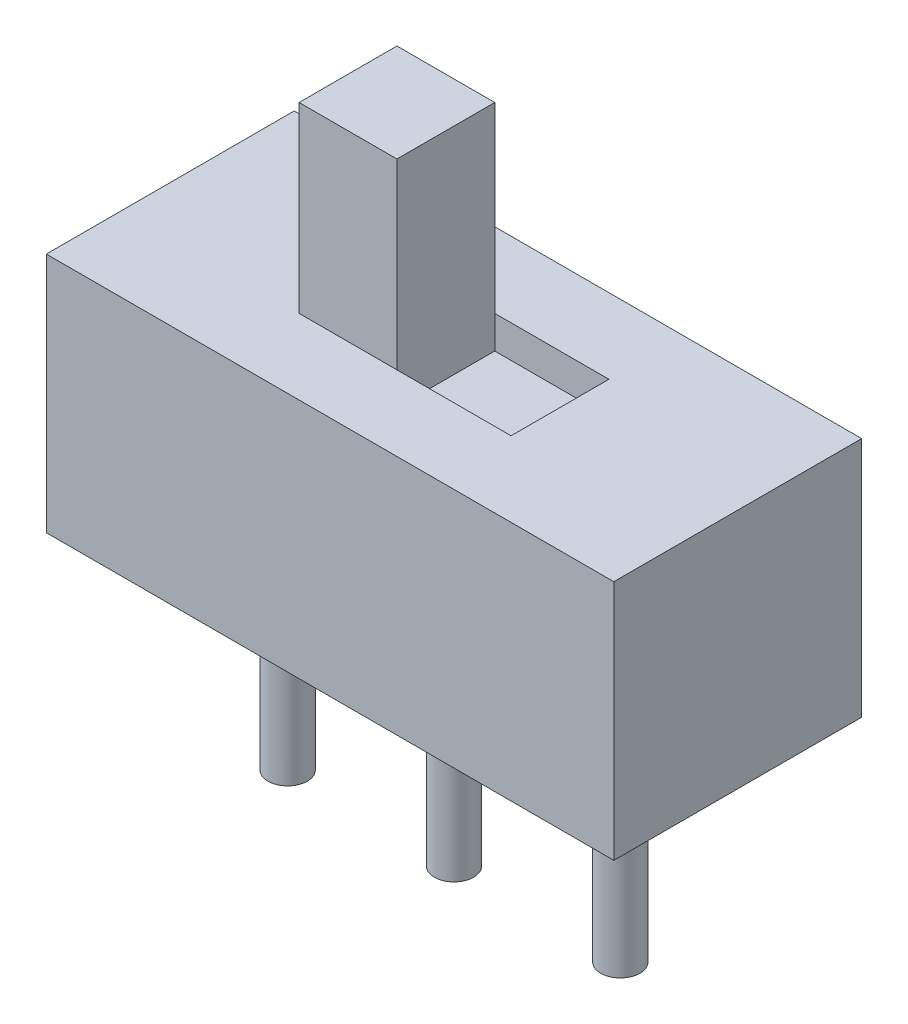
ISO-10303-21;
HEADER;
FILE_DESCRIPTION(('STEP AP214'),'2;1');
FILE_NAME('part.step','',(''),(''),'','','');
FILE_SCHEMA(('AUTOMOTIVE_DESIGN { 1 0 10303 214 1 1 1 1 }'));
ENDSEC;
DATA;
#1=APPLICATION_CONTEXT('core data for automotive mechanical design processes');
#2=APPLICATION_PROTOCOL_DEFINITION('international standard','automotive_design',2000,#1);
#3=PRODUCT_CONTEXT('',#1,'mechanical');
#4=PRODUCT('Part','Part','',(#3));
#5=PRODUCT_RELATED_PRODUCT_CATEGORY('part','',(#4));
#6=PRODUCT_DEFINITION_FORMATION('','',#4);
#7=PRODUCT_DEFINITION_CONTEXT('part definition',#1,'design');
#8=PRODUCT_DEFINITION('design','',#6,#7);
#9=PRODUCT_DEFINITION_SHAPE('','',#8);
#10=(LENGTH_UNIT() NAMED_UNIT(*) SI_UNIT(.MILLI.,.METRE.));
#11=(NAMED_UNIT(*) PLANE_ANGLE_UNIT() SI_UNIT($,.RADIAN.));
#12=(NAMED_UNIT(*) SI_UNIT($,.STERADIAN.) SOLID_ANGLE_UNIT());
#13=UNCERTAINTY_MEASURE_WITH_UNIT(LENGTH_MEASURE(1.E-05),#10,'distance_accuracy_value','');
#14=(GEOMETRIC_REPRESENTATION_CONTEXT(3) GLOBAL_UNCERTAINTY_ASSIGNED_CONTEXT((#13)) GLOBAL_UNIT_ASSIGNED_CONTEXT((#10,
#11,#12)) REPRESENTATION_CONTEXT('',''));
#15=CARTESIAN_POINT('',(0.,0.,0.));
#16=DIRECTION('',(0.,0.,1.));
#17=DIRECTION('',(1.,0.,0.));
#18=AXIS2_PLACEMENT_3D('',#15,#16,#17);
#19=CARTESIAN_POINT('',(2.725,6.5,1.15));
#20=DIRECTION('',(1.,0.,0.));
#21=DIRECTION('',(0.,0.,-1.));
#22=AXIS2_PLACEMENT_3D('',#19,#20,#21);
#23=PLANE('',#22);
#24=DIRECTION('',(0.,0.,1.));
#25=VECTOR('',#24,1.);
#26=CARTESIAN_POINT('',(2.725,3.2,1.15));
#27=LINE('',#26,#25);
#28=CARTESIAN_POINT('',(2.725,3.2,1.15));
#29=VERTEX_POINT('',#28);
#30=CARTESIAN_POINT('',(2.725,3.2,2.65));
#31=VERTEX_POINT('',#30);
#32=EDGE_CURVE('E109',#29,#31,#27,.T.);
#33=ORIENTED_EDGE('',*,*,#32,.T.);
#34=DIRECTION('',(0.,-1.,0.));
#35=VECTOR('',#34,1.);
#36=CARTESIAN_POINT('',(2.725,6.5,2.65));
#37=LINE('',#36,#35);
#38=CARTESIAN_POINT('',(2.725,6.5,2.65));
#39=VERTEX_POINT('',#38);
#40=EDGE_CURVE('E12',#39,#31,#37,.T.);
#41=ORIENTED_EDGE('',*,*,#40,.F.);
#42=DIRECTION('',(0.,0.,1.));
#43=VECTOR('',#42,1.);
#44=CARTESIAN_POINT('',(2.725,6.5,1.15));
#45=LINE('',#44,#43);
#46=CARTESIAN_POINT('',(2.725,6.5,1.15));
#47=VERTEX_POINT('',#46);
#48=EDGE_CURVE('E97',#47,#39,#45,.T.);
#49=ORIENTED_EDGE('',*,*,#48,.F.);
#50=DIRECTION('',(0.,-1.,0.));
#51=VECTOR('',#50,1.);
#52=CARTESIAN_POINT('',(2.725,6.5,1.15));
#53=LINE('',#52,#51);
#54=EDGE_CURVE('E105',#47,#29,#53,.T.);
#55=ORIENTED_EDGE('',*,*,#54,.T.);
#56=EDGE_LOOP('',(#33,#41,#49,#55));
#57=FACE_BOUND('',#56,.T.);
#58=ADVANCED_FACE('F46',(#57),#23,.F.);
#59=CARTESIAN_POINT('',(2.725,6.5,2.65));
#60=DIRECTION('',(0.,0.,-1.));
#61=DIRECTION('',(-1.,0.,0.));
#62=AXIS2_PLACEMENT_3D('',#59,#60,#61);
#63=PLANE('',#62);
#64=DIRECTION('',(1.,0.,0.));
#65=VECTOR('',#64,1.);
#66=CARTESIAN_POINT('',(2.725,3.2,2.65));
#67=LINE('',#66,#65);
#68=CARTESIAN_POINT('',(4.225,3.2,2.65));
#69=VERTEX_POINT('',#68);
#70=EDGE_CURVE('E101',#31,#69,#67,.T.);
#71=ORIENTED_EDGE('',*,*,#70,.T.);
#72=DIRECTION('',(0.,-1.,0.));
#73=VECTOR('',#72,1.);
#74=CARTESIAN_POINT('',(4.225,6.5,2.65));
#75=LINE('',#74,#73);
#76=CARTESIAN_POINT('',(4.225,6.5,2.65));
#77=VERTEX_POINT('',#76);
#78=EDGE_CURVE('E54',#77,#69,#75,.T.);
#79=ORIENTED_EDGE('',*,*,#78,.F.);
#80=DIRECTION('',(1.,0.,0.));
#81=VECTOR('',#80,1.);
#82=CARTESIAN_POINT('',(2.725,6.5,2.65));
#83=LINE('',#82,#81);
#84=EDGE_CURVE('E92',#39,#77,#83,.T.);
#85=ORIENTED_EDGE('',*,*,#84,.F.);
#86=ORIENTED_EDGE('',*,*,#40,.T.);
#87=EDGE_LOOP('',(#71,#79,#85,#86));
#88=FACE_BOUND('',#87,.T.);
#89=ADVANCED_FACE('F100',(#88),#63,.F.);
#90=CARTESIAN_POINT('',(4.225,6.5,1.15));
#91=DIRECTION('',(-1.,0.,0.));
#92=DIRECTION('',(0.,0.,1.));
#93=AXIS2_PLACEMENT_3D('',#90,#91,#92);
#94=PLANE('',#93);
#95=DIRECTION('',(0.,0.,-1.));
#96=VECTOR('',#95,1.);
#97=CARTESIAN_POINT('',(4.225,3.2,1.15));
#98=LINE('',#97,#96);
#99=CARTESIAN_POINT('',(4.225,3.2,1.15));
#100=VERTEX_POINT('',#99);
#101=EDGE_CURVE('E79',#69,#100,#98,.T.);
#102=ORIENTED_EDGE('',*,*,#101,.T.);
#103=DIRECTION('',(0.,-1.,0.));
#104=VECTOR('',#103,1.);
#105=CARTESIAN_POINT('',(4.225,6.5,1.15));
#106=LINE('',#105,#104);
#107=CARTESIAN_POINT('',(4.225,6.5,1.15));
#108=VERTEX_POINT('',#107);
#109=EDGE_CURVE('E102',#108,#100,#106,.T.);
#110=ORIENTED_EDGE('',*,*,#109,.F.);
#111=DIRECTION('',(0.,0.,-1.));
#112=VECTOR('',#111,1.);
#113=CARTESIAN_POINT('',(4.225,6.5,1.15));
#114=LINE('',#113,#112);
#115=EDGE_CURVE('E95',#77,#108,#114,.T.);
#116=ORIENTED_EDGE('',*,*,#115,.F.);
#117=ORIENTED_EDGE('',*,*,#78,.T.);
#118=EDGE_LOOP('',(#102,#110,#116,#117));
#119=FACE_BOUND('',#118,.T.);
#120=ADVANCED_FACE('F103',(#119),#94,.F.);
#121=CARTESIAN_POINT('',(2.725,6.5,1.15));
#122=DIRECTION('',(0.,0.,1.));
#123=DIRECTION('',(1.,0.,0.));
#124=AXIS2_PLACEMENT_3D('',#121,#122,#123);
#125=PLANE('',#124);
#126=DIRECTION('',(-1.,0.,0.));
#127=VECTOR('',#126,1.);
#128=CARTESIAN_POINT('',(2.725,3.2,1.15));
#129=LINE('',#128,#127);
#130=EDGE_CURVE('E85',#100,#29,#129,.T.);
#131=ORIENTED_EDGE('',*,*,#130,.T.);
#132=ORIENTED_EDGE('',*,*,#54,.F.);
#133=DIRECTION('',(-1.,0.,0.));
#134=VECTOR('',#133,1.);
#135=CARTESIAN_POINT('',(2.725,6.5,1.15));
#136=LINE('',#135,#134);
#137=EDGE_CURVE('E62',#108,#47,#136,.T.);
#138=ORIENTED_EDGE('',*,*,#137,.F.);
#139=ORIENTED_EDGE('',*,*,#109,.T.);
#140=EDGE_LOOP('',(#131,#132,#138,#139));
#141=FACE_BOUND('',#140,.T.);
#142=ADVANCED_FACE('F116',(#141),#125,.F.);
#143=CARTESIAN_POINT('',(0.,6.5,0.));
#144=DIRECTION('',(0.,1.,0.));
#145=DIRECTION('',(0.,0.,1.));
#146=AXIS2_PLACEMENT_3D('',#143,#144,#145);
#147=PLANE('',#146);
#148=ORIENTED_EDGE('',*,*,#48,.T.);
#149=ORIENTED_EDGE('',*,*,#84,.T.);
#150=ORIENTED_EDGE('',*,*,#115,.T.);
#151=ORIENTED_EDGE('',*,*,#137,.T.);
#152=EDGE_LOOP('',(#148,#149,#150,#151));
#153=FACE_BOUND('',#152,.T.);
#154=ADVANCED_FACE('F93',(#153),#147,.T.);
#155=CARTESIAN_POINT('',(0.,3.2,0.));
#156=DIRECTION('',(0.,1.,0.));
#157=DIRECTION('',(0.,0.,1.));
#158=AXIS2_PLACEMENT_3D('',#155,#156,#157);
#159=PLANE('',#158);
#160=ORIENTED_EDGE('',*,*,#32,.F.);
#161=ORIENTED_EDGE('',*,*,#130,.F.);
#162=ORIENTED_EDGE('',*,*,#101,.F.);
#163=ORIENTED_EDGE('',*,*,#70,.F.);
#164=EDGE_LOOP('',(#160,#161,#162,#163));
#165=FACE_BOUND('',#164,.T.);
#166=ADVANCED_FACE('F119',(#165),#159,.F.);
#167=CLOSED_SHELL('',(#58,#89,#120,#142,#154,#166));
#168=MANIFOLD_SOLID_BREP('B2',#167);
#169=CARTESIAN_POINT('',(0.,0.,3.8));
#170=DIRECTION('',(1.,0.,0.));
#171=DIRECTION('',(0.,0.,-1.));
#172=AXIS2_PLACEMENT_3D('',#169,#170,#171);
#173=PLANE('',#172);
#174=DIRECTION('',(0.,-1.,0.));
#175=VECTOR('',#174,1.);
#176=CARTESIAN_POINT('',(0.,0.,0.));
#177=LINE('',#176,#175);
#178=CARTESIAN_POINT('',(0.,3.7,0.));
#179=VERTEX_POINT('',#178);
#180=CARTESIAN_POINT('',(0.,0.,0.));
#181=VERTEX_POINT('',#180);
#182=EDGE_CURVE('E291',#179,#181,#177,.T.);
#183=ORIENTED_EDGE('',*,*,#182,.T.);
#184=DIRECTION('',(0.,0.,-1.));
#185=VECTOR('',#184,1.);
#186=CARTESIAN_POINT('',(0.,0.,3.8));
#187=LINE('',#186,#185);
#188=CARTESIAN_POINT('',(0.,0.,3.8));
#189=VERTEX_POINT('',#188);
#190=EDGE_CURVE('E315',#189,#181,#187,.T.);
#191=ORIENTED_EDGE('',*,*,#190,.F.);
#192=DIRECTION('',(0.,-1.,0.));
#193=VECTOR('',#192,1.);
#194=CARTESIAN_POINT('',(0.,0.,3.8));
#195=LINE('',#194,#193);
#196=CARTESIAN_POINT('',(0.,3.7,3.8));
#197=VERTEX_POINT('',#196);
#198=EDGE_CURVE('E295',#197,#189,#195,.T.);
#199=ORIENTED_EDGE('',*,*,#198,.F.);
#200=DIRECTION('',(0.,0.,-1.));
#201=VECTOR('',#200,1.);
#202=CARTESIAN_POINT('',(0.,3.7,3.8));
#203=LINE('',#202,#201);
#204=EDGE_CURVE('E301',#197,#179,#203,.T.);
#205=ORIENTED_EDGE('',*,*,#204,.T.);
#206=EDGE_LOOP('',(#183,#191,#199,#205));
#207=FACE_BOUND('',#206,.T.);
#208=ADVANCED_FACE('F179',(#207),#173,.F.);
#209=CARTESIAN_POINT('',(0.,0.,3.8));
#210=DIRECTION('',(0.,1.,0.));
#211=DIRECTION('',(0.,0.,1.));
#212=AXIS2_PLACEMENT_3D('',#209,#210,#211);
#213=PLANE('',#212);
#214=CARTESIAN_POINT('',(6.9,0.,1.9));
#215=DIRECTION('',(0.,1.,0.));
#216=DIRECTION('',(0.,0.,1.));
#217=AXIS2_PLACEMENT_3D('',#214,#215,#216);
#218=CIRCLE('',#217,0.3);
#219=CARTESIAN_POINT('',(6.9,0.,2.2));
#220=VERTEX_POINT('',#219);
#221=EDGE_CURVE('E44',#220,#220,#218,.F.);
#222=ORIENTED_EDGE('',*,*,#221,.F.);
#223=EDGE_LOOP('',(#222));
#224=FACE_BOUND('',#223,.T.);
#225=CARTESIAN_POINT('',(4.35,0.,1.9));
#226=DIRECTION('',(0.,1.,0.));
#227=DIRECTION('',(0.,0.,1.));
#228=AXIS2_PLACEMENT_3D('',#225,#226,#227);
#229=CIRCLE('',#228,0.3);
#230=CARTESIAN_POINT('',(4.35,0.,2.2));
#231=VERTEX_POINT('',#230);
#232=EDGE_CURVE('E186',#231,#231,#229,.F.);
#233=ORIENTED_EDGE('',*,*,#232,.F.);
#234=EDGE_LOOP('',(#233));
#235=FACE_BOUND('',#234,.T.);
#236=CARTESIAN_POINT('',(1.8,0.,1.9));
#237=DIRECTION('',(0.,1.,0.));
#238=DIRECTION('',(0.,0.,1.));
#239=AXIS2_PLACEMENT_3D('',#236,#237,#238);
#240=CIRCLE('',#239,0.3);
#241=CARTESIAN_POINT('',(1.8,0.,2.2));
#242=VERTEX_POINT('',#241);
#243=EDGE_CURVE('E317',#242,#242,#240,.F.);
#244=ORIENTED_EDGE('',*,*,#243,.F.);
#245=EDGE_LOOP('',(#244));
#246=FACE_BOUND('',#245,.T.);
#247=DIRECTION('',(1.,0.,0.));
#248=VECTOR('',#247,1.);
#249=CARTESIAN_POINT('',(0.,0.,0.));
#250=LINE('',#249,#248);
#251=CARTESIAN_POINT('',(8.7,0.,0.));
#252=VERTEX_POINT('',#251);
#253=EDGE_CURVE('E304',#181,#252,#250,.T.);
#254=ORIENTED_EDGE('',*,*,#253,.T.);
#255=DIRECTION('',(0.,0.,-1.));
#256=VECTOR('',#255,1.);
#257=CARTESIAN_POINT('',(8.7,0.,3.8));
#258=LINE('',#257,#256);
#259=CARTESIAN_POINT('',(8.7,0.,3.8));
#260=VERTEX_POINT('',#259);
#261=EDGE_CURVE('E312',#260,#252,#258,.T.);
#262=ORIENTED_EDGE('',*,*,#261,.F.);
#263=DIRECTION('',(1.,0.,0.));
#264=VECTOR('',#263,1.);
#265=CARTESIAN_POINT('',(0.,0.,3.8));
#266=LINE('',#265,#264);
#267=EDGE_CURVE('E231',#189,#260,#266,.T.);
#268=ORIENTED_EDGE('',*,*,#267,.F.);
#269=ORIENTED_EDGE('',*,*,#190,.T.);
#270=EDGE_LOOP('',(#254,#262,#268,#269));
#271=FACE_BOUND('',#270,.T.);
#272=ADVANCED_FACE('F324',(#224,#235,#246,#271),#213,.F.);
#273=CARTESIAN_POINT('',(8.7,0.,3.8));
#274=DIRECTION('',(-1.,0.,0.));
#275=DIRECTION('',(0.,0.,1.));
#276=AXIS2_PLACEMENT_3D('',#273,#274,#275);
#277=PLANE('',#276);
#278=DIRECTION('',(0.,1.,0.));
#279=VECTOR('',#278,1.);
#280=CARTESIAN_POINT('',(8.7,0.,0.));
#281=LINE('',#280,#279);
#282=CARTESIAN_POINT('',(8.7,3.7,0.));
#283=VERTEX_POINT('',#282);
#284=EDGE_CURVE('E306',#252,#283,#281,.T.);
#285=ORIENTED_EDGE('',*,*,#284,.T.);
#286=DIRECTION('',(0.,0.,-1.));
#287=VECTOR('',#286,1.);
#288=CARTESIAN_POINT('',(8.7,3.7,3.8));
#289=LINE('',#288,#287);
#290=CARTESIAN_POINT('',(8.7,3.7,3.8));
#291=VERTEX_POINT('',#290);
#292=EDGE_CURVE('E310',#291,#283,#289,.T.);
#293=ORIENTED_EDGE('',*,*,#292,.F.);
#294=DIRECTION('',(0.,1.,0.));
#295=VECTOR('',#294,1.);
#296=CARTESIAN_POINT('',(8.7,0.,3.8));
#297=LINE('',#296,#295);
#298=EDGE_CURVE('E298',#260,#291,#297,.T.);
#299=ORIENTED_EDGE('',*,*,#298,.F.);
#300=ORIENTED_EDGE('',*,*,#261,.T.);
#301=EDGE_LOOP('',(#285,#293,#299,#300));
#302=FACE_BOUND('',#301,.T.);
#303=ADVANCED_FACE('F327',(#302),#277,.F.);
#304=CARTESIAN_POINT('',(0.,3.7,3.8));
#305=DIRECTION('',(0.,-1.,0.));
#306=DIRECTION('',(0.,0.,-1.));
#307=AXIS2_PLACEMENT_3D('',#304,#305,#306);
#308=PLANE('',#307);
#309=DIRECTION('',(-1.,0.,0.));
#310=VECTOR('',#309,1.);
#311=CARTESIAN_POINT('',(2.725,3.7,1.15));
#312=LINE('',#311,#310);
#313=CARTESIAN_POINT('',(5.975,3.7,1.15));
#314=VERTEX_POINT('',#313);
#315=CARTESIAN_POINT('',(2.725,3.7,1.15));
#316=VERTEX_POINT('',#315);
#317=EDGE_CURVE('E285',#314,#316,#312,.T.);
#318=ORIENTED_EDGE('',*,*,#317,.F.);
#319=DIRECTION('',(0.,0.,-1.));
#320=VECTOR('',#319,1.);
#321=CARTESIAN_POINT('',(5.975,3.7,2.65));
#322=LINE('',#321,#320);
#323=CARTESIAN_POINT('',(5.975,3.7,2.65));
#324=VERTEX_POINT('',#323);
#325=EDGE_CURVE('E193',#324,#314,#322,.T.);
#326=ORIENTED_EDGE('',*,*,#325,.F.);
#327=DIRECTION('',(1.,0.,0.));
#328=VECTOR('',#327,1.);
#329=CARTESIAN_POINT('',(2.725,3.7,2.65));
#330=LINE('',#329,#328);
#331=CARTESIAN_POINT('',(2.725,3.7,2.65));
#332=VERTEX_POINT('',#331);
#333=EDGE_CURVE('E273',#332,#324,#330,.T.);
#334=ORIENTED_EDGE('',*,*,#333,.F.);
#335=DIRECTION('',(0.,0.,1.));
#336=VECTOR('',#335,1.);
#337=CARTESIAN_POINT('',(2.725,3.7,2.65));
#338=LINE('',#337,#336);
#339=EDGE_CURVE('E276',#316,#332,#338,.T.);
#340=ORIENTED_EDGE('',*,*,#339,.F.);
#341=EDGE_LOOP('',(#318,#326,#334,#340));
#342=FACE_BOUND('',#341,.T.);
#343=DIRECTION('',(-1.,0.,0.));
#344=VECTOR('',#343,1.);
#345=CARTESIAN_POINT('',(0.,3.7,0.));
#346=LINE('',#345,#344);
#347=EDGE_CURVE('E223',#283,#179,#346,.T.);
#348=ORIENTED_EDGE('',*,*,#347,.T.);
#349=ORIENTED_EDGE('',*,*,#204,.F.);
#350=DIRECTION('',(-1.,0.,0.));
#351=VECTOR('',#350,1.);
#352=CARTESIAN_POINT('',(0.,3.7,3.8));
#353=LINE('',#352,#351);
#354=EDGE_CURVE('E202',#291,#197,#353,.T.);
#355=ORIENTED_EDGE('',*,*,#354,.F.);
#356=ORIENTED_EDGE('',*,*,#292,.T.);
#357=EDGE_LOOP('',(#348,#349,#355,#356));
#358=FACE_BOUND('',#357,.T.);
#359=ADVANCED_FACE('F340',(#342,#358),#308,.F.);
#360=CARTESIAN_POINT('',(0.,0.,3.8));
#361=DIRECTION('',(0.,0.,-1.));
#362=DIRECTION('',(-1.,0.,0.));
#363=AXIS2_PLACEMENT_3D('',#360,#361,#362);
#364=PLANE('',#363);
#365=ORIENTED_EDGE('',*,*,#198,.T.);
#366=ORIENTED_EDGE('',*,*,#267,.T.);
#367=ORIENTED_EDGE('',*,*,#298,.T.);
#368=ORIENTED_EDGE('',*,*,#354,.T.);
#369=EDGE_LOOP('',(#365,#366,#367,#368));
#370=FACE_BOUND('',#369,.T.);
#371=ADVANCED_FACE('F342',(#370),#364,.F.);
#372=CARTESIAN_POINT('',(0.,0.,0.));
#373=DIRECTION('',(0.,0.,-1.));
#374=DIRECTION('',(-1.,0.,0.));
#375=AXIS2_PLACEMENT_3D('',#372,#373,#374);
#376=PLANE('',#375);
#377=ORIENTED_EDGE('',*,*,#182,.F.);
#378=ORIENTED_EDGE('',*,*,#347,.F.);
#379=ORIENTED_EDGE('',*,*,#284,.F.);
#380=ORIENTED_EDGE('',*,*,#253,.F.);
#381=EDGE_LOOP('',(#377,#378,#379,#380));
#382=FACE_BOUND('',#381,.T.);
#383=ADVANCED_FACE('F337',(#382),#376,.T.);
#384=CARTESIAN_POINT('',(5.975,3.2,2.65));
#385=DIRECTION('',(1.,0.,0.));
#386=DIRECTION('',(0.,0.,-1.));
#387=AXIS2_PLACEMENT_3D('',#384,#385,#386);
#388=PLANE('',#387);
#389=ORIENTED_EDGE('',*,*,#325,.T.);
#390=DIRECTION('',(0.,1.,0.));
#391=VECTOR('',#390,1.);
#392=CARTESIAN_POINT('',(5.975,3.2,1.15));
#393=LINE('',#392,#391);
#394=CARTESIAN_POINT('',(5.975,3.2,1.15));
#395=VERTEX_POINT('',#394);
#396=EDGE_CURVE('E251',#395,#314,#393,.T.);
#397=ORIENTED_EDGE('',*,*,#396,.F.);
#398=DIRECTION('',(0.,0.,-1.));
#399=VECTOR('',#398,1.);
#400=CARTESIAN_POINT('',(5.975,3.2,2.65));
#401=LINE('',#400,#399);
#402=CARTESIAN_POINT('',(5.975,3.2,2.65));
#403=VERTEX_POINT('',#402);
#404=EDGE_CURVE('E255',#403,#395,#401,.T.);
#405=ORIENTED_EDGE('',*,*,#404,.F.);
#406=DIRECTION('',(0.,1.,0.));
#407=VECTOR('',#406,1.);
#408=CARTESIAN_POINT('',(5.975,3.2,2.65));
#409=LINE('',#408,#407);
#410=EDGE_CURVE('E289',#403,#324,#409,.T.);
#411=ORIENTED_EDGE('',*,*,#410,.T.);
#412=EDGE_LOOP('',(#389,#397,#405,#411));
#413=FACE_BOUND('',#412,.T.);
#414=ADVANCED_FACE('F253',(#413),#388,.F.);
#415=CARTESIAN_POINT('',(2.725,3.2,2.65));
#416=DIRECTION('',(0.,0.,1.));
#417=DIRECTION('',(1.,0.,0.));
#418=AXIS2_PLACEMENT_3D('',#415,#416,#417);
#419=PLANE('',#418);
#420=ORIENTED_EDGE('',*,*,#333,.T.);
#421=ORIENTED_EDGE('',*,*,#410,.F.);
#422=DIRECTION('',(1.,0.,0.));
#423=VECTOR('',#422,1.);
#424=CARTESIAN_POINT('',(2.725,3.2,2.65));
#425=LINE('',#424,#423);
#426=CARTESIAN_POINT('',(2.725,3.2,2.65));
#427=VERTEX_POINT('',#426);
#428=EDGE_CURVE('E261',#427,#403,#425,.T.);
#429=ORIENTED_EDGE('',*,*,#428,.F.);
#430=DIRECTION('',(0.,1.,0.));
#431=VECTOR('',#430,1.);
#432=CARTESIAN_POINT('',(2.725,3.2,2.65));
#433=LINE('',#432,#431);
#434=EDGE_CURVE('E292',#427,#332,#433,.T.);
#435=ORIENTED_EDGE('',*,*,#434,.T.);
#436=EDGE_LOOP('',(#420,#421,#429,#435));
#437=FACE_BOUND('',#436,.T.);
#438=ADVANCED_FACE('F389',(#437),#419,.F.);
#439=CARTESIAN_POINT('',(2.725,3.2,2.65));
#440=DIRECTION('',(-1.,0.,0.));
#441=DIRECTION('',(0.,0.,1.));
#442=AXIS2_PLACEMENT_3D('',#439,#440,#441);
#443=PLANE('',#442);
#444=ORIENTED_EDGE('',*,*,#339,.T.);
#445=ORIENTED_EDGE('',*,*,#434,.F.);
#446=DIRECTION('',(0.,0.,1.));
#447=VECTOR('',#446,1.);
#448=CARTESIAN_POINT('',(2.725,3.2,2.65));
#449=LINE('',#448,#447);
#450=CARTESIAN_POINT('',(2.725,3.2,1.15));
#451=VERTEX_POINT('',#450);
#452=EDGE_CURVE('E269',#451,#427,#449,.T.);
#453=ORIENTED_EDGE('',*,*,#452,.F.);
#454=DIRECTION('',(0.,1.,0.));
#455=VECTOR('',#454,1.);
#456=CARTESIAN_POINT('',(2.725,3.2,1.15));
#457=LINE('',#456,#455);
#458=EDGE_CURVE('E260',#451,#316,#457,.T.);
#459=ORIENTED_EDGE('',*,*,#458,.T.);
#460=EDGE_LOOP('',(#444,#445,#453,#459));
#461=FACE_BOUND('',#460,.T.);
#462=ADVANCED_FACE('F400',(#461),#443,.F.);
#463=CARTESIAN_POINT('',(2.725,3.2,1.15));
#464=DIRECTION('',(0.,0.,-1.));
#465=DIRECTION('',(-1.,0.,0.));
#466=AXIS2_PLACEMENT_3D('',#463,#464,#465);
#467=PLANE('',#466);
#468=ORIENTED_EDGE('',*,*,#317,.T.);
#469=ORIENTED_EDGE('',*,*,#458,.F.);
#470=DIRECTION('',(-1.,0.,0.));
#471=VECTOR('',#470,1.);
#472=CARTESIAN_POINT('',(2.725,3.2,1.15));
#473=LINE('',#472,#471);
#474=EDGE_CURVE('E264',#395,#451,#473,.T.);
#475=ORIENTED_EDGE('',*,*,#474,.F.);
#476=ORIENTED_EDGE('',*,*,#396,.T.);
#477=EDGE_LOOP('',(#468,#469,#475,#476));
#478=FACE_BOUND('',#477,.T.);
#479=ADVANCED_FACE('F265',(#478),#467,.F.);
#480=CARTESIAN_POINT('',(0.,3.2,0.));
#481=DIRECTION('',(0.,-1.,0.));
#482=DIRECTION('',(0.,0.,-1.));
#483=AXIS2_PLACEMENT_3D('',#480,#481,#482);
#484=PLANE('',#483);
#485=ORIENTED_EDGE('',*,*,#404,.T.);
#486=ORIENTED_EDGE('',*,*,#474,.T.);
#487=ORIENTED_EDGE('',*,*,#452,.T.);
#488=ORIENTED_EDGE('',*,*,#428,.T.);
#489=EDGE_LOOP('',(#485,#486,#487,#488));
#490=FACE_BOUND('',#489,.T.);
#491=ADVANCED_FACE('F271',(#490),#484,.F.);
#492=CARTESIAN_POINT('',(1.8,-3.2,1.9));
#493=DIRECTION('',(0.,1.,0.));
#494=DIRECTION('',(0.,0.,1.));
#495=AXIS2_PLACEMENT_3D('',#492,#493,#494);
#496=CYLINDRICAL_SURFACE('',#495,0.3);
#497=CARTESIAN_POINT('',(1.8,-3.2,1.9));
#498=DIRECTION('',(0.,-1.,0.));
#499=DIRECTION('',(0.,0.,-1.));
#500=AXIS2_PLACEMENT_3D('',#497,#498,#499);
#501=CIRCLE('',#500,0.3);
#502=CARTESIAN_POINT('',(1.8,-3.2,1.6));
#503=VERTEX_POINT('',#502);
#504=EDGE_CURVE('E279',#503,#503,#501,.T.);
#505=ORIENTED_EDGE('',*,*,#504,.F.);
#506=EDGE_LOOP('',(#505));
#507=FACE_BOUND('',#506,.T.);
#508=ORIENTED_EDGE('',*,*,#243,.T.);
#509=EDGE_LOOP('',(#508));
#510=FACE_BOUND('',#509,.T.);
#511=ADVANCED_FACE('F426',(#507,#510),#496,.T.);
#512=CARTESIAN_POINT('',(1.8,-3.2,1.9));
#513=DIRECTION('',(0.,-1.,0.));
#514=DIRECTION('',(0.,0.,-1.));
#515=AXIS2_PLACEMENT_3D('',#512,#513,#514);
#516=PLANE('',#515);
#517=ORIENTED_EDGE('',*,*,#504,.T.);
#518=EDGE_LOOP('',(#517));
#519=FACE_BOUND('',#518,.T.);
#520=ADVANCED_FACE('F441',(#519),#516,.T.);
#521=CARTESIAN_POINT('',(4.35,-3.2,1.9));
#522=DIRECTION('',(0.,1.,0.));
#523=DIRECTION('',(0.,0.,1.));
#524=AXIS2_PLACEMENT_3D('',#521,#522,#523);
#525=CYLINDRICAL_SURFACE('',#524,0.3);
#526=CARTESIAN_POINT('',(4.35,-3.2,1.9));
#527=DIRECTION('',(0.,-1.,0.));
#528=DIRECTION('',(0.,0.,-1.));
#529=AXIS2_PLACEMENT_3D('',#526,#527,#528);
#530=CIRCLE('',#529,0.3);
#531=CARTESIAN_POINT('',(4.35,-3.2,1.6));
#532=VERTEX_POINT('',#531);
#533=EDGE_CURVE('E507',#532,#532,#530,.T.);
#534=ORIENTED_EDGE('',*,*,#533,.F.);
#535=EDGE_LOOP('',(#534));
#536=FACE_BOUND('',#535,.T.);
#537=ORIENTED_EDGE('',*,*,#232,.T.);
#538=EDGE_LOOP('',(#537));
#539=FACE_BOUND('',#538,.T.);
#540=ADVANCED_FACE('F322',(#536,#539),#525,.T.);
#541=CARTESIAN_POINT('',(4.35,-3.2,1.9));
#542=DIRECTION('',(0.,-1.,0.));
#543=DIRECTION('',(0.,0.,-1.));
#544=AXIS2_PLACEMENT_3D('',#541,#542,#543);
#545=PLANE('',#544);
#546=ORIENTED_EDGE('',*,*,#533,.T.);
#547=EDGE_LOOP('',(#546));
#548=FACE_BOUND('',#547,.T.);
#549=ADVANCED_FACE('F460',(#548),#545,.T.);
#550=CARTESIAN_POINT('',(6.9,-3.2,1.9));
#551=DIRECTION('',(0.,1.,0.));
#552=DIRECTION('',(0.,0.,1.));
#553=AXIS2_PLACEMENT_3D('',#550,#551,#552);
#554=CYLINDRICAL_SURFACE('',#553,0.3);
#555=CARTESIAN_POINT('',(6.9,-3.2,1.9));
#556=DIRECTION('',(0.,-1.,0.));
#557=DIRECTION('',(0.,0.,1.));
#558=AXIS2_PLACEMENT_3D('',#555,#556,#557);
#559=CIRCLE('',#558,0.3);
#560=CARTESIAN_POINT('',(6.9,-3.2,2.2));
#561=VERTEX_POINT('',#560);
#562=EDGE_CURVE('E506',#561,#561,#559,.T.);
#563=ORIENTED_EDGE('',*,*,#562,.F.);
#564=EDGE_LOOP('',(#563));
#565=FACE_BOUND('',#564,.T.);
#566=ORIENTED_EDGE('',*,*,#221,.T.);
#567=EDGE_LOOP('',(#566));
#568=FACE_BOUND('',#567,.T.);
#569=ADVANCED_FACE('F470',(#565,#568),#554,.T.);
#570=CARTESIAN_POINT('',(6.9,-3.2,1.9));
#571=DIRECTION('',(0.,1.,0.));
#572=DIRECTION('',(0.,0.,1.));
#573=AXIS2_PLACEMENT_3D('',#570,#571,#572);
#574=PLANE('',#573);
#575=ORIENTED_EDGE('',*,*,#562,.T.);
#576=EDGE_LOOP('',(#575));
#577=FACE_BOUND('',#576,.T.);
#578=ADVANCED_FACE('F480',(#577),#574,.F.);
#579=CLOSED_SHELL('',(#208,#272,#303,#359,#371,#383,#414,#438,#462,#479,#491,#511,#520,#540,
#549,#569,#578));
#580=MANIFOLD_SOLID_BREP('B6',#579);
#581=ADVANCED_BREP_SHAPE_REPRESENTATION('',(#18,#168,#580),#14);
#582=SHAPE_DEFINITION_REPRESENTATION(#9,#581);
ENDSEC;
END-ISO-10303-21;
